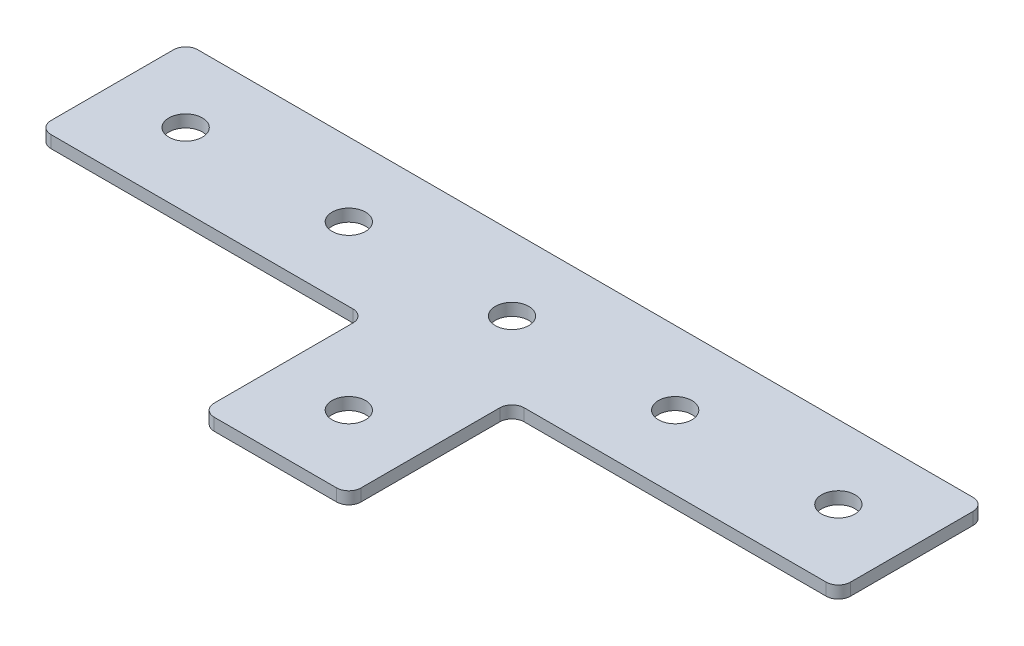
ISO-10303-21;
HEADER;
FILE_DESCRIPTION(('STEP AP214'),'2;1');
FILE_NAME('part.step','',(''),(''),'','','');
FILE_SCHEMA(('AUTOMOTIVE_DESIGN { 1 0 10303 214 1 1 1 1 }'));
ENDSEC;
DATA;
#1=APPLICATION_CONTEXT('core data for automotive mechanical design processes');
#2=APPLICATION_PROTOCOL_DEFINITION('international standard','automotive_design',2000,#1);
#3=PRODUCT_CONTEXT('',#1,'mechanical');
#4=PRODUCT('Part','Part','',(#3));
#5=PRODUCT_RELATED_PRODUCT_CATEGORY('part','',(#4));
#6=PRODUCT_DEFINITION_FORMATION('','',#4);
#7=PRODUCT_DEFINITION_CONTEXT('part definition',#1,'design');
#8=PRODUCT_DEFINITION('design','',#6,#7);
#9=PRODUCT_DEFINITION_SHAPE('','',#8);
#10=(LENGTH_UNIT() NAMED_UNIT(*) SI_UNIT(.MILLI.,.METRE.));
#11=(NAMED_UNIT(*) PLANE_ANGLE_UNIT() SI_UNIT($,.RADIAN.));
#12=(NAMED_UNIT(*) SI_UNIT($,.STERADIAN.) SOLID_ANGLE_UNIT());
#13=UNCERTAINTY_MEASURE_WITH_UNIT(LENGTH_MEASURE(1.E-05),#10,'distance_accuracy_value','');
#14=(GEOMETRIC_REPRESENTATION_CONTEXT(3) GLOBAL_UNCERTAINTY_ASSIGNED_CONTEXT((#13)) GLOBAL_UNIT_ASSIGNED_CONTEXT((#10,
#11,#12)) REPRESENTATION_CONTEXT('',''));
#15=CARTESIAN_POINT('',(0.,0.,0.));
#16=DIRECTION('',(0.,0.,1.));
#17=DIRECTION('',(1.,0.,0.));
#18=AXIS2_PLACEMENT_3D('',#15,#16,#17);
#19=CARTESIAN_POINT('',(-1.67011649585902,1.64126526075142,-21.4706382626173));
#20=DIRECTION('',(0.,-1.,0.));
#21=DIRECTION('',(0.,0.,-1.));
#22=AXIS2_PLACEMENT_3D('',#19,#20,#21);
#23=PLANE('',#22);
#24=CARTESIAN_POINT('',(-1.67011649585902,1.64126526075142,-21.4706382626173));
#25=DIRECTION('',(0.,1.,0.));
#26=DIRECTION('',(0.,0.,1.));
#27=AXIS2_PLACEMENT_3D('',#24,#25,#26);
#28=CIRCLE('',#27,4.1);
#29=CARTESIAN_POINT('',(-1.67011649585902,1.64126526075142,-17.3706382626173));
#30=VERTEX_POINT('',#29);
#31=EDGE_CURVE('E219',#30,#30,#28,.T.);
#32=ORIENTED_EDGE('',*,*,#31,.T.);
#33=EDGE_LOOP('',(#32));
#34=FACE_BOUND('',#33,.T.);
#35=DIRECTION('',(1.,0.,0.));
#36=VECTOR('',#35,1.);
#37=CARTESIAN_POINT('',(-19.670116495859,1.64126526075142,36.5293617373827));
#38=LINE('',#37,#36);
#39=CARTESIAN_POINT('',(-16.670116495859,1.64126526075142,36.5293617373827));
#40=VERTEX_POINT('',#39);
#41=CARTESIAN_POINT('',(13.3298835041409,1.64126526075142,36.5293617373827));
#42=VERTEX_POINT('',#41);
#43=EDGE_CURVE('E231',#40,#42,#38,.T.);
#44=ORIENTED_EDGE('',*,*,#43,.F.);
#45=CARTESIAN_POINT('',(-16.670116495859,1.64126526075142,33.5293617373827));
#46=DIRECTION('',(0.,1.,0.));
#47=DIRECTION('',(0.,0.,-1.));
#48=AXIS2_PLACEMENT_3D('',#45,#46,#47);
#49=CIRCLE('',#48,3.);
#50=CARTESIAN_POINT('',(-19.670116495859,1.64126526075142,33.5293617373827));
#51=VERTEX_POINT('',#50);
#52=EDGE_CURVE('E181',#51,#40,#49,.T.);
#53=ORIENTED_EDGE('',*,*,#52,.F.);
#54=DIRECTION('',(0.,0.,-1.));
#55=VECTOR('',#54,1.);
#56=CARTESIAN_POINT('',(-19.670116495859,1.64126526075142,36.5293617373827));
#57=LINE('',#56,#55);
#58=CARTESIAN_POINT('',(-19.670116495859,1.64126526075142,-0.470638262617281));
#59=VERTEX_POINT('',#58);
#60=EDGE_CURVE('E302',#51,#59,#57,.T.);
#61=ORIENTED_EDGE('',*,*,#60,.T.);
#62=CARTESIAN_POINT('',(-22.670116495859,1.64126526075142,-0.470638262617281));
#63=DIRECTION('',(0.,1.,0.));
#64=DIRECTION('',(0.,0.,-1.));
#65=AXIS2_PLACEMENT_3D('',#62,#63,#64);
#66=CIRCLE('',#65,3.);
#67=CARTESIAN_POINT('',(-22.670116495859,1.64126526075142,-3.47063826261728));
#68=VERTEX_POINT('',#67);
#69=EDGE_CURVE('E197',#68,#59,#66,.F.);
#70=ORIENTED_EDGE('',*,*,#69,.F.);
#71=DIRECTION('',(-1.,0.,0.));
#72=VECTOR('',#71,1.);
#73=CARTESIAN_POINT('',(-19.670116495859,1.64126526075142,-3.47063826261728));
#74=LINE('',#73,#72);
#75=CARTESIAN_POINT('',(-96.670116495859,1.64126526075142,-3.47063826261727));
#76=VERTEX_POINT('',#75);
#77=EDGE_CURVE('E167',#68,#76,#74,.T.);
#78=ORIENTED_EDGE('',*,*,#77,.T.);
#79=CARTESIAN_POINT('',(-96.670116495859,1.64126526075142,-6.47063826261726));
#80=DIRECTION('',(0.,1.,0.));
#81=DIRECTION('',(0.,0.,-1.));
#82=AXIS2_PLACEMENT_3D('',#79,#80,#81);
#83=CIRCLE('',#82,3.);
#84=CARTESIAN_POINT('',(-99.670116495859,1.64126526075142,-6.47063826261726));
#85=VERTEX_POINT('',#84);
#86=EDGE_CURVE('E179',#85,#76,#83,.T.);
#87=ORIENTED_EDGE('',*,*,#86,.F.);
#88=DIRECTION('',(0.,0.,-1.));
#89=VECTOR('',#88,1.);
#90=CARTESIAN_POINT('',(-99.670116495859,1.64126526075142,-3.47063826261727));
#91=LINE('',#90,#89);
#92=CARTESIAN_POINT('',(-99.670116495859,1.64126526075142,-36.4706382626173));
#93=VERTEX_POINT('',#92);
#94=EDGE_CURVE('E147',#85,#93,#91,.T.);
#95=ORIENTED_EDGE('',*,*,#94,.T.);
#96=CARTESIAN_POINT('',(-96.670116495859,1.64126526075142,-36.4706382626173));
#97=DIRECTION('',(0.,1.,0.));
#98=DIRECTION('',(0.,0.,-1.));
#99=AXIS2_PLACEMENT_3D('',#96,#97,#98);
#100=CIRCLE('',#99,3.);
#101=CARTESIAN_POINT('',(-96.670116495859,1.64126526075142,-39.4706382626173));
#102=VERTEX_POINT('',#101);
#103=EDGE_CURVE('E176',#102,#93,#100,.T.);
#104=ORIENTED_EDGE('',*,*,#103,.F.);
#105=DIRECTION('',(-1.,0.,0.));
#106=VECTOR('',#105,1.);
#107=CARTESIAN_POINT('',(96.329883504141,1.64126526075142,-39.4706382626173));
#108=LINE('',#107,#106);
#109=CARTESIAN_POINT('',(93.329883504141,1.64126526075142,-39.4706382626173));
#110=VERTEX_POINT('',#109);
#111=EDGE_CURVE('E228',#110,#102,#108,.T.);
#112=ORIENTED_EDGE('',*,*,#111,.F.);
#113=CARTESIAN_POINT('',(93.329883504141,1.64126526075142,-36.4706382626173));
#114=DIRECTION('',(0.,-1.,0.));
#115=DIRECTION('',(0.,0.,-1.));
#116=AXIS2_PLACEMENT_3D('',#113,#114,#115);
#117=CIRCLE('',#116,3.);
#118=CARTESIAN_POINT('',(96.329883504141,1.64126526075142,-36.4706382626173));
#119=VERTEX_POINT('',#118);
#120=EDGE_CURVE('E258',#110,#119,#117,.T.);
#121=ORIENTED_EDGE('',*,*,#120,.T.);
#122=DIRECTION('',(0.,0.,-1.));
#123=VECTOR('',#122,1.);
#124=CARTESIAN_POINT('',(96.329883504141,1.64126526075142,-3.47063826261729));
#125=LINE('',#124,#123);
#126=CARTESIAN_POINT('',(96.329883504141,1.64126526075142,-6.47063826261729));
#127=VERTEX_POINT('',#126);
#128=EDGE_CURVE('E225',#127,#119,#125,.T.);
#129=ORIENTED_EDGE('',*,*,#128,.F.);
#130=CARTESIAN_POINT('',(93.329883504141,1.64126526075142,-6.47063826261729));
#131=DIRECTION('',(0.,-1.,0.));
#132=DIRECTION('',(0.,0.,-1.));
#133=AXIS2_PLACEMENT_3D('',#130,#131,#132);
#134=CIRCLE('',#133,3.);
#135=CARTESIAN_POINT('',(93.329883504141,1.64126526075142,-3.47063826261729));
#136=VERTEX_POINT('',#135);
#137=EDGE_CURVE('E260',#127,#136,#134,.T.);
#138=ORIENTED_EDGE('',*,*,#137,.T.);
#139=DIRECTION('',(1.,0.,0.));
#140=VECTOR('',#139,1.);
#141=CARTESIAN_POINT('',(16.3298835041409,1.64126526075142,-3.47063826261729));
#142=LINE('',#141,#140);
#143=CARTESIAN_POINT('',(19.3298835041409,1.64126526075142,-3.47063826261729));
#144=VERTEX_POINT('',#143);
#145=EDGE_CURVE('E235',#144,#136,#142,.T.);
#146=ORIENTED_EDGE('',*,*,#145,.F.);
#147=CARTESIAN_POINT('',(19.3298835041409,1.64126526075142,-0.470638262617284));
#148=DIRECTION('',(0.,-1.,0.));
#149=DIRECTION('',(0.,0.,-1.));
#150=AXIS2_PLACEMENT_3D('',#147,#148,#149);
#151=CIRCLE('',#150,3.);
#152=CARTESIAN_POINT('',(16.3298835041409,1.64126526075142,-0.470638262617284));
#153=VERTEX_POINT('',#152);
#154=EDGE_CURVE('E10',#144,#153,#151,.F.);
#155=ORIENTED_EDGE('',*,*,#154,.T.);
#156=DIRECTION('',(0.,0.,-1.));
#157=VECTOR('',#156,1.);
#158=CARTESIAN_POINT('',(16.3298835041409,1.64126526075142,36.5293617373827));
#159=LINE('',#158,#157);
#160=CARTESIAN_POINT('',(16.3298835041409,1.64126526075142,33.5293617373827));
#161=VERTEX_POINT('',#160);
#162=EDGE_CURVE('E233',#161,#153,#159,.T.);
#163=ORIENTED_EDGE('',*,*,#162,.F.);
#164=CARTESIAN_POINT('',(13.3298835041409,1.64126526075142,33.5293617373827));
#165=DIRECTION('',(0.,-1.,0.));
#166=DIRECTION('',(0.,0.,-1.));
#167=AXIS2_PLACEMENT_3D('',#164,#165,#166);
#168=CIRCLE('',#167,3.);
#169=EDGE_CURVE('E262',#161,#42,#168,.T.);
#170=ORIENTED_EDGE('',*,*,#169,.T.);
#171=EDGE_LOOP('',(#44,#53,#61,#70,#78,#87,#95,#104,#112,#121,#129,#138,#146,#155,#163,#170));
#172=FACE_BOUND('',#171,.T.);
#173=CARTESIAN_POINT('',(-1.67011649585903,1.64126526075142,18.5293617373827));
#174=DIRECTION('',(0.,1.,0.));
#175=DIRECTION('',(0.,0.,1.));
#176=AXIS2_PLACEMENT_3D('',#173,#174,#175);
#177=CIRCLE('',#176,4.1);
#178=CARTESIAN_POINT('',(-1.67011649585903,1.64126526075142,22.6293617373827));
#179=VERTEX_POINT('',#178);
#180=EDGE_CURVE('E207',#179,#179,#177,.T.);
#181=ORIENTED_EDGE('',*,*,#180,.T.);
#182=EDGE_LOOP('',(#181));
#183=FACE_BOUND('',#182,.T.);
#184=CARTESIAN_POINT('',(78.329883504141,1.64126526075142,-21.4706382626173));
#185=DIRECTION('',(0.,1.,0.));
#186=DIRECTION('',(0.,0.,1.));
#187=AXIS2_PLACEMENT_3D('',#184,#185,#186);
#188=CIRCLE('',#187,4.1);
#189=CARTESIAN_POINT('',(78.329883504141,1.64126526075142,-17.3706382626173));
#190=VERTEX_POINT('',#189);
#191=EDGE_CURVE('E201',#190,#190,#188,.T.);
#192=ORIENTED_EDGE('',*,*,#191,.T.);
#193=EDGE_LOOP('',(#192));
#194=FACE_BOUND('',#193,.T.);
#195=CARTESIAN_POINT('',(38.329883504141,1.64126526075142,-21.4706382626172));
#196=DIRECTION('',(0.,1.,0.));
#197=DIRECTION('',(0.,0.,1.));
#198=AXIS2_PLACEMENT_3D('',#195,#196,#197);
#199=CIRCLE('',#198,4.1);
#200=CARTESIAN_POINT('',(38.329883504141,1.64126526075142,-17.3706382626173));
#201=VERTEX_POINT('',#200);
#202=EDGE_CURVE('E213',#201,#201,#199,.T.);
#203=ORIENTED_EDGE('',*,*,#202,.T.);
#204=EDGE_LOOP('',(#203));
#205=FACE_BOUND('',#204,.T.);
#206=CARTESIAN_POINT('',(-81.670116495859,1.64126526075142,-21.4706382626172));
#207=DIRECTION('',(0.,-1.,0.));
#208=DIRECTION('',(0.,0.,1.));
#209=AXIS2_PLACEMENT_3D('',#206,#207,#208);
#210=CIRCLE('',#209,4.1);
#211=CARTESIAN_POINT('',(-81.670116495859,1.64126526075142,-17.3706382626172));
#212=VERTEX_POINT('',#211);
#213=EDGE_CURVE('E313',#212,#212,#210,.T.);
#214=ORIENTED_EDGE('',*,*,#213,.F.);
#215=EDGE_LOOP('',(#214));
#216=FACE_BOUND('',#215,.T.);
#217=CARTESIAN_POINT('',(-41.670116495859,1.64126526075142,-21.4706382626172));
#218=DIRECTION('',(0.,-1.,0.));
#219=DIRECTION('',(0.,0.,1.));
#220=AXIS2_PLACEMENT_3D('',#217,#218,#219);
#221=CIRCLE('',#220,4.1);
#222=CARTESIAN_POINT('',(-41.670116495859,1.64126526075142,-17.3706382626172));
#223=VERTEX_POINT('',#222);
#224=EDGE_CURVE('E158',#223,#223,#221,.T.);
#225=ORIENTED_EDGE('',*,*,#224,.F.);
#226=EDGE_LOOP('',(#225));
#227=FACE_BOUND('',#226,.T.);
#228=ADVANCED_FACE('F16',(#34,#172,#183,#194,#205,#216,#227),#23,.T.);
#229=CARTESIAN_POINT('',(96.329883504141,1.64126526075142,-3.47063826261729));
#230=DIRECTION('',(1.,0.,0.));
#231=DIRECTION('',(0.,0.,-1.));
#232=AXIS2_PLACEMENT_3D('',#229,#230,#231);
#233=PLANE('',#232);
#234=DIRECTION('',(0.,0.,-1.));
#235=VECTOR('',#234,1.);
#236=CARTESIAN_POINT('',(96.329883504141,4.64126526075142,-3.47063826261729));
#237=LINE('',#236,#235);
#238=CARTESIAN_POINT('',(96.329883504141,4.64126526075142,-6.47063826261729));
#239=VERTEX_POINT('',#238);
#240=CARTESIAN_POINT('',(96.329883504141,4.64126526075142,-36.4706382626173));
#241=VERTEX_POINT('',#240);
#242=EDGE_CURVE('E222',#239,#241,#237,.T.);
#243=ORIENTED_EDGE('',*,*,#242,.F.);
#244=DIRECTION('',(0.,1.,0.));
#245=VECTOR('',#244,1.);
#246=CARTESIAN_POINT('',(96.329883504141,1.64126526075142,-6.47063826261729));
#247=LINE('',#246,#245);
#248=EDGE_CURVE('E277',#239,#127,#247,.F.);
#249=ORIENTED_EDGE('',*,*,#248,.T.);
#250=ORIENTED_EDGE('',*,*,#128,.T.);
#251=DIRECTION('',(0.,1.,0.));
#252=VECTOR('',#251,1.);
#253=CARTESIAN_POINT('',(96.329883504141,1.64126526075142,-36.4706382626173));
#254=LINE('',#253,#252);
#255=EDGE_CURVE('E274',#119,#241,#254,.T.);
#256=ORIENTED_EDGE('',*,*,#255,.T.);
#257=EDGE_LOOP('',(#243,#249,#250,#256));
#258=FACE_BOUND('',#257,.T.);
#259=ADVANCED_FACE('F326',(#258),#233,.T.);
#260=CARTESIAN_POINT('',(16.3298835041409,1.64126526075142,-3.47063826261729));
#261=DIRECTION('',(0.,0.,1.));
#262=DIRECTION('',(1.,0.,0.));
#263=AXIS2_PLACEMENT_3D('',#260,#261,#262);
#264=PLANE('',#263);
#265=DIRECTION('',(1.,0.,0.));
#266=VECTOR('',#265,1.);
#267=CARTESIAN_POINT('',(16.3298835041409,4.64126526075142,-3.47063826261729));
#268=LINE('',#267,#266);
#269=CARTESIAN_POINT('',(19.3298835041409,4.64126526075142,-3.47063826261729));
#270=VERTEX_POINT('',#269);
#271=CARTESIAN_POINT('',(93.329883504141,4.64126526075142,-3.47063826261729));
#272=VERTEX_POINT('',#271);
#273=EDGE_CURVE('E229',#270,#272,#268,.T.);
#274=ORIENTED_EDGE('',*,*,#273,.F.);
#275=DIRECTION('',(0.,1.,0.));
#276=VECTOR('',#275,1.);
#277=CARTESIAN_POINT('',(19.3298835041409,1.64126526075142,-3.47063826261729));
#278=LINE('',#277,#276);
#279=EDGE_CURVE('E272',#270,#144,#278,.F.);
#280=ORIENTED_EDGE('',*,*,#279,.T.);
#281=ORIENTED_EDGE('',*,*,#145,.T.);
#282=DIRECTION('',(0.,1.,0.));
#283=VECTOR('',#282,1.);
#284=CARTESIAN_POINT('',(93.329883504141,1.64126526075142,-3.47063826261729));
#285=LINE('',#284,#283);
#286=EDGE_CURVE('E269',#136,#272,#285,.T.);
#287=ORIENTED_EDGE('',*,*,#286,.T.);
#288=EDGE_LOOP('',(#274,#280,#281,#287));
#289=FACE_BOUND('',#288,.T.);
#290=ADVANCED_FACE('F285',(#289),#264,.T.);
#291=CARTESIAN_POINT('',(16.3298835041409,1.64126526075142,36.5293617373827));
#292=DIRECTION('',(1.,0.,0.));
#293=DIRECTION('',(0.,0.,-1.));
#294=AXIS2_PLACEMENT_3D('',#291,#292,#293);
#295=PLANE('',#294);
#296=DIRECTION('',(0.,0.,-1.));
#297=VECTOR('',#296,1.);
#298=CARTESIAN_POINT('',(16.3298835041409,4.64126526075142,36.5293617373827));
#299=LINE('',#298,#297);
#300=CARTESIAN_POINT('',(16.3298835041409,4.64126526075142,33.5293617373827));
#301=VERTEX_POINT('',#300);
#302=CARTESIAN_POINT('',(16.3298835041409,4.64126526075142,-0.470638262617284));
#303=VERTEX_POINT('',#302);
#304=EDGE_CURVE('E245',#301,#303,#299,.T.);
#305=ORIENTED_EDGE('',*,*,#304,.F.);
#306=DIRECTION('',(0.,1.,0.));
#307=VECTOR('',#306,1.);
#308=CARTESIAN_POINT('',(16.3298835041409,1.64126526075142,33.5293617373827));
#309=LINE('',#308,#307);
#310=EDGE_CURVE('E36',#301,#161,#309,.F.);
#311=ORIENTED_EDGE('',*,*,#310,.T.);
#312=ORIENTED_EDGE('',*,*,#162,.T.);
#313=DIRECTION('',(0.,1.,0.));
#314=VECTOR('',#313,1.);
#315=CARTESIAN_POINT('',(16.3298835041409,4.64126526075142,-0.470638262617284));
#316=LINE('',#315,#314);
#317=EDGE_CURVE('E265',#153,#303,#316,.T.);
#318=ORIENTED_EDGE('',*,*,#317,.T.);
#319=EDGE_LOOP('',(#305,#311,#312,#318));
#320=FACE_BOUND('',#319,.T.);
#321=ADVANCED_FACE('F288',(#320),#295,.T.);
#322=CARTESIAN_POINT('',(-19.670116495859,1.64126526075142,36.5293617373827));
#323=DIRECTION('',(0.,0.,1.));
#324=DIRECTION('',(1.,0.,0.));
#325=AXIS2_PLACEMENT_3D('',#322,#323,#324);
#326=PLANE('',#325);
#327=DIRECTION('',(1.,0.,0.));
#328=VECTOR('',#327,1.);
#329=CARTESIAN_POINT('',(-19.670116495859,4.64126526075142,36.5293617373827));
#330=LINE('',#329,#328);
#331=CARTESIAN_POINT('',(-16.670116495859,4.64126526075142,36.5293617373827));
#332=VERTEX_POINT('',#331);
#333=CARTESIAN_POINT('',(13.3298835041409,4.64126526075142,36.5293617373827));
#334=VERTEX_POINT('',#333);
#335=EDGE_CURVE('E243',#332,#334,#330,.T.);
#336=ORIENTED_EDGE('',*,*,#335,.F.);
#337=DIRECTION('',(0.,1.,0.));
#338=VECTOR('',#337,1.);
#339=CARTESIAN_POINT('',(-16.670116495859,1.64126526075142,36.5293617373827));
#340=LINE('',#339,#338);
#341=EDGE_CURVE('E173',#40,#332,#340,.T.);
#342=ORIENTED_EDGE('',*,*,#341,.F.);
#343=ORIENTED_EDGE('',*,*,#43,.T.);
#344=DIRECTION('',(0.,1.,0.));
#345=VECTOR('',#344,1.);
#346=CARTESIAN_POINT('',(13.3298835041409,1.64126526075142,36.5293617373827));
#347=LINE('',#346,#345);
#348=EDGE_CURVE('E255',#42,#334,#347,.T.);
#349=ORIENTED_EDGE('',*,*,#348,.T.);
#350=EDGE_LOOP('',(#336,#342,#343,#349));
#351=FACE_BOUND('',#350,.T.);
#352=ADVANCED_FACE('F296',(#351),#326,.T.);
#353=CARTESIAN_POINT('',(96.329883504141,1.64126526075142,-39.4706382626173));
#354=DIRECTION('',(0.,0.,-1.));
#355=DIRECTION('',(-1.,0.,0.));
#356=AXIS2_PLACEMENT_3D('',#353,#354,#355);
#357=PLANE('',#356);
#358=ORIENTED_EDGE('',*,*,#111,.T.);
#359=DIRECTION('',(0.,1.,0.));
#360=VECTOR('',#359,1.);
#361=CARTESIAN_POINT('',(-96.670116495859,1.64126526075142,-39.4706382626173));
#362=LINE('',#361,#360);
#363=CARTESIAN_POINT('',(-96.670116495859,4.64126526075142,-39.4706382626173));
#364=VERTEX_POINT('',#363);
#365=EDGE_CURVE('E149',#364,#102,#362,.F.);
#366=ORIENTED_EDGE('',*,*,#365,.F.);
#367=DIRECTION('',(-1.,0.,0.));
#368=VECTOR('',#367,1.);
#369=CARTESIAN_POINT('',(96.329883504141,4.64126526075142,-39.4706382626173));
#370=LINE('',#369,#368);
#371=CARTESIAN_POINT('',(93.329883504141,4.64126526075142,-39.4706382626173));
#372=VERTEX_POINT('',#371);
#373=EDGE_CURVE('E241',#372,#364,#370,.T.);
#374=ORIENTED_EDGE('',*,*,#373,.F.);
#375=DIRECTION('',(0.,1.,0.));
#376=VECTOR('',#375,1.);
#377=CARTESIAN_POINT('',(93.329883504141,1.64126526075142,-39.4706382626173));
#378=LINE('',#377,#376);
#379=EDGE_CURVE('E279',#372,#110,#378,.F.);
#380=ORIENTED_EDGE('',*,*,#379,.T.);
#381=EDGE_LOOP('',(#358,#366,#374,#380));
#382=FACE_BOUND('',#381,.T.);
#383=ADVANCED_FACE('F339',(#382),#357,.T.);
#384=CARTESIAN_POINT('',(-1.67011649585902,4.64126526075142,-21.4706382626173));
#385=DIRECTION('',(0.,-1.,0.));
#386=DIRECTION('',(0.,0.,-1.));
#387=AXIS2_PLACEMENT_3D('',#384,#385,#386);
#388=PLANE('',#387);
#389=CARTESIAN_POINT('',(-1.67011649585902,4.64126526075142,-21.4706382626173));
#390=DIRECTION('',(0.,1.,0.));
#391=DIRECTION('',(0.,0.,1.));
#392=AXIS2_PLACEMENT_3D('',#389,#390,#391);
#393=CIRCLE('',#392,4.1);
#394=CARTESIAN_POINT('',(-1.67011649585902,4.64126526075142,-17.3706382626173));
#395=VERTEX_POINT('',#394);
#396=EDGE_CURVE('E216',#395,#395,#393,.T.);
#397=ORIENTED_EDGE('',*,*,#396,.F.);
#398=EDGE_LOOP('',(#397));
#399=FACE_BOUND('',#398,.T.);
#400=CARTESIAN_POINT('',(-16.670116495859,4.64126526075142,33.5293617373827));
#401=DIRECTION('',(0.,1.,0.));
#402=DIRECTION('',(0.,0.,-1.));
#403=AXIS2_PLACEMENT_3D('',#400,#401,#402);
#404=CIRCLE('',#403,3.);
#405=CARTESIAN_POINT('',(-19.670116495859,4.64126526075142,33.5293617373827));
#406=VERTEX_POINT('',#405);
#407=EDGE_CURVE('E139',#332,#406,#404,.F.);
#408=ORIENTED_EDGE('',*,*,#407,.F.);
#409=ORIENTED_EDGE('',*,*,#335,.T.);
#410=CARTESIAN_POINT('',(13.3298835041409,4.64126526075142,33.5293617373827));
#411=DIRECTION('',(0.,-1.,0.));
#412=DIRECTION('',(0.,0.,-1.));
#413=AXIS2_PLACEMENT_3D('',#410,#411,#412);
#414=CIRCLE('',#413,3.);
#415=EDGE_CURVE('E253',#334,#301,#414,.F.);
#416=ORIENTED_EDGE('',*,*,#415,.T.);
#417=ORIENTED_EDGE('',*,*,#304,.T.);
#418=CARTESIAN_POINT('',(19.3298835041409,4.64126526075142,-0.470638262617284));
#419=DIRECTION('',(0.,-1.,0.));
#420=DIRECTION('',(0.,0.,-1.));
#421=AXIS2_PLACEMENT_3D('',#418,#419,#420);
#422=CIRCLE('',#421,3.);
#423=EDGE_CURVE('E24',#303,#270,#422,.T.);
#424=ORIENTED_EDGE('',*,*,#423,.T.);
#425=ORIENTED_EDGE('',*,*,#273,.T.);
#426=CARTESIAN_POINT('',(93.329883504141,4.64126526075142,-6.47063826261729));
#427=DIRECTION('',(0.,-1.,0.));
#428=DIRECTION('',(0.,0.,-1.));
#429=AXIS2_PLACEMENT_3D('',#426,#427,#428);
#430=CIRCLE('',#429,3.);
#431=EDGE_CURVE('E251',#272,#239,#430,.F.);
#432=ORIENTED_EDGE('',*,*,#431,.T.);
#433=ORIENTED_EDGE('',*,*,#242,.T.);
#434=CARTESIAN_POINT('',(93.329883504141,4.64126526075142,-36.4706382626173));
#435=DIRECTION('',(0.,-1.,0.));
#436=DIRECTION('',(0.,0.,-1.));
#437=AXIS2_PLACEMENT_3D('',#434,#435,#436);
#438=CIRCLE('',#437,3.);
#439=EDGE_CURVE('E238',#241,#372,#438,.F.);
#440=ORIENTED_EDGE('',*,*,#439,.T.);
#441=ORIENTED_EDGE('',*,*,#373,.T.);
#442=CARTESIAN_POINT('',(-96.670116495859,4.64126526075142,-36.4706382626173));
#443=DIRECTION('',(0.,1.,0.));
#444=DIRECTION('',(0.,0.,-1.));
#445=AXIS2_PLACEMENT_3D('',#442,#443,#444);
#446=CIRCLE('',#445,3.);
#447=CARTESIAN_POINT('',(-99.670116495859,4.64126526075142,-36.4706382626173));
#448=VERTEX_POINT('',#447);
#449=EDGE_CURVE('E140',#448,#364,#446,.F.);
#450=ORIENTED_EDGE('',*,*,#449,.F.);
#451=DIRECTION('',(0.,0.,-1.));
#452=VECTOR('',#451,1.);
#453=CARTESIAN_POINT('',(-99.670116495859,4.64126526075142,-3.47063826261727));
#454=LINE('',#453,#452);
#455=CARTESIAN_POINT('',(-99.670116495859,4.64126526075142,-6.47063826261726));
#456=VERTEX_POINT('',#455);
#457=EDGE_CURVE('E145',#456,#448,#454,.T.);
#458=ORIENTED_EDGE('',*,*,#457,.F.);
#459=CARTESIAN_POINT('',(-96.670116495859,4.64126526075142,-6.47063826261726));
#460=DIRECTION('',(0.,1.,0.));
#461=DIRECTION('',(0.,0.,-1.));
#462=AXIS2_PLACEMENT_3D('',#459,#460,#461);
#463=CIRCLE('',#462,3.);
#464=CARTESIAN_POINT('',(-96.670116495859,4.64126526075142,-3.47063826261727));
#465=VERTEX_POINT('',#464);
#466=EDGE_CURVE('E128',#465,#456,#463,.F.);
#467=ORIENTED_EDGE('',*,*,#466,.F.);
#468=DIRECTION('',(-1.,0.,0.));
#469=VECTOR('',#468,1.);
#470=CARTESIAN_POINT('',(-19.670116495859,4.64126526075142,-3.47063826261728));
#471=LINE('',#470,#469);
#472=CARTESIAN_POINT('',(-22.670116495859,4.64126526075142,-3.47063826261728));
#473=VERTEX_POINT('',#472);
#474=EDGE_CURVE('E161',#473,#465,#471,.T.);
#475=ORIENTED_EDGE('',*,*,#474,.F.);
#476=CARTESIAN_POINT('',(-22.670116495859,4.64126526075142,-0.470638262617281));
#477=DIRECTION('',(0.,1.,0.));
#478=DIRECTION('',(0.,0.,-1.));
#479=AXIS2_PLACEMENT_3D('',#476,#477,#478);
#480=CIRCLE('',#479,3.);
#481=CARTESIAN_POINT('',(-19.670116495859,4.64126526075142,-0.470638262617281));
#482=VERTEX_POINT('',#481);
#483=EDGE_CURVE('E195',#482,#473,#480,.T.);
#484=ORIENTED_EDGE('',*,*,#483,.F.);
#485=DIRECTION('',(0.,0.,-1.));
#486=VECTOR('',#485,1.);
#487=CARTESIAN_POINT('',(-19.670116495859,4.64126526075142,36.5293617373827));
#488=LINE('',#487,#486);
#489=EDGE_CURVE('E157',#406,#482,#488,.T.);
#490=ORIENTED_EDGE('',*,*,#489,.F.);
#491=EDGE_LOOP('',(#408,#409,#416,#417,#424,#425,#432,#433,#440,#441,#450,#458,#467,#475,#484,#490));
#492=FACE_BOUND('',#491,.T.);
#493=CARTESIAN_POINT('',(78.329883504141,4.64126526075142,-21.4706382626173));
#494=DIRECTION('',(0.,1.,0.));
#495=DIRECTION('',(0.,0.,1.));
#496=AXIS2_PLACEMENT_3D('',#493,#494,#495);
#497=CIRCLE('',#496,4.1);
#498=CARTESIAN_POINT('',(78.329883504141,4.64126526075142,-17.3706382626173));
#499=VERTEX_POINT('',#498);
#500=EDGE_CURVE('E200',#499,#499,#497,.T.);
#501=ORIENTED_EDGE('',*,*,#500,.F.);
#502=EDGE_LOOP('',(#501));
#503=FACE_BOUND('',#502,.T.);
#504=CARTESIAN_POINT('',(38.329883504141,4.64126526075142,-21.4706382626172));
#505=DIRECTION('',(0.,1.,0.));
#506=DIRECTION('',(0.,0.,1.));
#507=AXIS2_PLACEMENT_3D('',#504,#505,#506);
#508=CIRCLE('',#507,4.1);
#509=CARTESIAN_POINT('',(38.329883504141,4.64126526075142,-17.3706382626173));
#510=VERTEX_POINT('',#509);
#511=EDGE_CURVE('E210',#510,#510,#508,.T.);
#512=ORIENTED_EDGE('',*,*,#511,.F.);
#513=EDGE_LOOP('',(#512));
#514=FACE_BOUND('',#513,.T.);
#515=CARTESIAN_POINT('',(-1.67011649585903,4.64126526075142,18.5293617373827));
#516=DIRECTION('',(0.,1.,0.));
#517=DIRECTION('',(0.,0.,1.));
#518=AXIS2_PLACEMENT_3D('',#515,#516,#517);
#519=CIRCLE('',#518,4.1);
#520=CARTESIAN_POINT('',(-1.67011649585903,4.64126526075142,22.6293617373827));
#521=VERTEX_POINT('',#520);
#522=EDGE_CURVE('E204',#521,#521,#519,.T.);
#523=ORIENTED_EDGE('',*,*,#522,.F.);
#524=EDGE_LOOP('',(#523));
#525=FACE_BOUND('',#524,.T.);
#526=CARTESIAN_POINT('',(-81.670116495859,4.64126526075142,-21.4706382626172));
#527=DIRECTION('',(0.,-1.,0.));
#528=DIRECTION('',(0.,0.,1.));
#529=AXIS2_PLACEMENT_3D('',#526,#527,#528);
#530=CIRCLE('',#529,4.1);
#531=CARTESIAN_POINT('',(-81.670116495859,4.64126526075142,-17.3706382626172));
#532=VERTEX_POINT('',#531);
#533=EDGE_CURVE('E315',#532,#532,#530,.T.);
#534=ORIENTED_EDGE('',*,*,#533,.T.);
#535=EDGE_LOOP('',(#534));
#536=FACE_BOUND('',#535,.T.);
#537=CARTESIAN_POINT('',(-41.670116495859,4.64126526075142,-21.4706382626172));
#538=DIRECTION('',(0.,-1.,0.));
#539=DIRECTION('',(0.,0.,1.));
#540=AXIS2_PLACEMENT_3D('',#537,#538,#539);
#541=CIRCLE('',#540,4.1);
#542=CARTESIAN_POINT('',(-41.670116495859,4.64126526075142,-17.3706382626172));
#543=VERTEX_POINT('',#542);
#544=EDGE_CURVE('E164',#543,#543,#541,.T.);
#545=ORIENTED_EDGE('',*,*,#544,.T.);
#546=EDGE_LOOP('',(#545));
#547=FACE_BOUND('',#546,.T.);
#548=ADVANCED_FACE('F153',(#399,#492,#503,#514,#525,#536,#547),#388,.F.);
#549=CARTESIAN_POINT('',(13.3298835041409,1.64126526075142,33.5293617373827));
#550=DIRECTION('',(0.,1.,0.));
#551=DIRECTION('',(0.,0.,1.));
#552=AXIS2_PLACEMENT_3D('',#549,#550,#551);
#553=CYLINDRICAL_SURFACE('',#552,3.);
#554=ORIENTED_EDGE('',*,*,#169,.F.);
#555=ORIENTED_EDGE('',*,*,#310,.F.);
#556=ORIENTED_EDGE('',*,*,#415,.F.);
#557=ORIENTED_EDGE('',*,*,#348,.F.);
#558=EDGE_LOOP('',(#554,#555,#556,#557));
#559=FACE_BOUND('',#558,.T.);
#560=ADVANCED_FACE('F293',(#559),#553,.T.);
#561=CARTESIAN_POINT('',(19.3298835041409,1.64126526075142,-0.470638262617284));
#562=DIRECTION('',(0.,-1.,0.));
#563=DIRECTION('',(0.,0.,-1.));
#564=AXIS2_PLACEMENT_3D('',#561,#562,#563);
#565=CYLINDRICAL_SURFACE('',#564,3.);
#566=ORIENTED_EDGE('',*,*,#154,.F.);
#567=ORIENTED_EDGE('',*,*,#279,.F.);
#568=ORIENTED_EDGE('',*,*,#423,.F.);
#569=ORIENTED_EDGE('',*,*,#317,.F.);
#570=EDGE_LOOP('',(#566,#567,#568,#569));
#571=FACE_BOUND('',#570,.T.);
#572=ADVANCED_FACE('F287',(#571),#565,.F.);
#573=CARTESIAN_POINT('',(93.329883504141,1.64126526075142,-6.47063826261729));
#574=DIRECTION('',(0.,1.,0.));
#575=DIRECTION('',(0.,0.,1.));
#576=AXIS2_PLACEMENT_3D('',#573,#574,#575);
#577=CYLINDRICAL_SURFACE('',#576,3.);
#578=ORIENTED_EDGE('',*,*,#137,.F.);
#579=ORIENTED_EDGE('',*,*,#248,.F.);
#580=ORIENTED_EDGE('',*,*,#431,.F.);
#581=ORIENTED_EDGE('',*,*,#286,.F.);
#582=EDGE_LOOP('',(#578,#579,#580,#581));
#583=FACE_BOUND('',#582,.T.);
#584=ADVANCED_FACE('F354',(#583),#577,.T.);
#585=CARTESIAN_POINT('',(93.329883504141,1.64126526075142,-36.4706382626173));
#586=DIRECTION('',(0.,1.,0.));
#587=DIRECTION('',(0.,0.,1.));
#588=AXIS2_PLACEMENT_3D('',#585,#586,#587);
#589=CYLINDRICAL_SURFACE('',#588,3.);
#590=ORIENTED_EDGE('',*,*,#120,.F.);
#591=ORIENTED_EDGE('',*,*,#379,.F.);
#592=ORIENTED_EDGE('',*,*,#439,.F.);
#593=ORIENTED_EDGE('',*,*,#255,.F.);
#594=EDGE_LOOP('',(#590,#591,#592,#593));
#595=FACE_BOUND('',#594,.T.);
#596=ADVANCED_FACE('F18',(#595),#589,.T.);
#597=CARTESIAN_POINT('',(-1.67011649585902,1.64126526075142,-21.4706382626173));
#598=DIRECTION('',(0.,1.,0.));
#599=DIRECTION('',(0.,0.,1.));
#600=AXIS2_PLACEMENT_3D('',#597,#598,#599);
#601=CYLINDRICAL_SURFACE('',#600,4.1);
#602=ORIENTED_EDGE('',*,*,#31,.F.);
#603=EDGE_LOOP('',(#602));
#604=FACE_BOUND('',#603,.T.);
#605=ORIENTED_EDGE('',*,*,#396,.T.);
#606=EDGE_LOOP('',(#605));
#607=FACE_BOUND('',#606,.T.);
#608=ADVANCED_FACE('F360',(#604,#607),#601,.F.);
#609=CARTESIAN_POINT('',(38.329883504141,1.64126526075142,-21.4706382626172));
#610=DIRECTION('',(0.,1.,0.));
#611=DIRECTION('',(0.,0.,1.));
#612=AXIS2_PLACEMENT_3D('',#609,#610,#611);
#613=CYLINDRICAL_SURFACE('',#612,4.1);
#614=ORIENTED_EDGE('',*,*,#202,.F.);
#615=EDGE_LOOP('',(#614));
#616=FACE_BOUND('',#615,.T.);
#617=ORIENTED_EDGE('',*,*,#511,.T.);
#618=EDGE_LOOP('',(#617));
#619=FACE_BOUND('',#618,.T.);
#620=ADVANCED_FACE('F400',(#616,#619),#613,.F.);
#621=CARTESIAN_POINT('',(-1.67011649585903,1.64126526075142,18.5293617373827));
#622=DIRECTION('',(0.,1.,0.));
#623=DIRECTION('',(0.,0.,1.));
#624=AXIS2_PLACEMENT_3D('',#621,#622,#623);
#625=CYLINDRICAL_SURFACE('',#624,4.1);
#626=ORIENTED_EDGE('',*,*,#522,.T.);
#627=EDGE_LOOP('',(#626));
#628=FACE_BOUND('',#627,.T.);
#629=ORIENTED_EDGE('',*,*,#180,.F.);
#630=EDGE_LOOP('',(#629));
#631=FACE_BOUND('',#630,.T.);
#632=ADVANCED_FACE('F396',(#628,#631),#625,.F.);
#633=CARTESIAN_POINT('',(78.329883504141,1.64126526075142,-21.4706382626173));
#634=DIRECTION('',(0.,1.,0.));
#635=DIRECTION('',(0.,0.,1.));
#636=AXIS2_PLACEMENT_3D('',#633,#634,#635);
#637=CYLINDRICAL_SURFACE('',#636,4.1);
#638=ORIENTED_EDGE('',*,*,#191,.F.);
#639=EDGE_LOOP('',(#638));
#640=FACE_BOUND('',#639,.T.);
#641=ORIENTED_EDGE('',*,*,#500,.T.);
#642=EDGE_LOOP('',(#641));
#643=FACE_BOUND('',#642,.T.);
#644=ADVANCED_FACE('F393',(#640,#643),#637,.F.);
#645=CARTESIAN_POINT('',(-99.670116495859,1.64126526075142,-3.47063826261727));
#646=DIRECTION('',(-1.,0.,0.));
#647=DIRECTION('',(0.,0.,-1.));
#648=AXIS2_PLACEMENT_3D('',#645,#646,#647);
#649=PLANE('',#648);
#650=ORIENTED_EDGE('',*,*,#457,.T.);
#651=DIRECTION('',(0.,1.,0.));
#652=VECTOR('',#651,1.);
#653=CARTESIAN_POINT('',(-99.670116495859,1.64126526075142,-36.4706382626173));
#654=LINE('',#653,#652);
#655=EDGE_CURVE('E150',#93,#448,#654,.T.);
#656=ORIENTED_EDGE('',*,*,#655,.F.);
#657=ORIENTED_EDGE('',*,*,#94,.F.);
#658=DIRECTION('',(0.,1.,0.));
#659=VECTOR('',#658,1.);
#660=CARTESIAN_POINT('',(-99.670116495859,1.64126526075142,-6.47063826261726));
#661=LINE('',#660,#659);
#662=EDGE_CURVE('E132',#456,#85,#661,.F.);
#663=ORIENTED_EDGE('',*,*,#662,.F.);
#664=EDGE_LOOP('',(#650,#656,#657,#663));
#665=FACE_BOUND('',#664,.T.);
#666=ADVANCED_FACE('F144',(#665),#649,.T.);
#667=CARTESIAN_POINT('',(-19.670116495859,1.64126526075142,-3.47063826261728));
#668=DIRECTION('',(0.,0.,1.));
#669=DIRECTION('',(-1.,0.,0.));
#670=AXIS2_PLACEMENT_3D('',#667,#668,#669);
#671=PLANE('',#670);
#672=ORIENTED_EDGE('',*,*,#474,.T.);
#673=DIRECTION('',(0.,1.,0.));
#674=VECTOR('',#673,1.);
#675=CARTESIAN_POINT('',(-96.670116495859,1.64126526075142,-3.47063826261727));
#676=LINE('',#675,#674);
#677=EDGE_CURVE('E134',#76,#465,#676,.T.);
#678=ORIENTED_EDGE('',*,*,#677,.F.);
#679=ORIENTED_EDGE('',*,*,#77,.F.);
#680=DIRECTION('',(0.,1.,0.));
#681=VECTOR('',#680,1.);
#682=CARTESIAN_POINT('',(-22.670116495859,1.64126526075142,-3.47063826261728));
#683=LINE('',#682,#681);
#684=EDGE_CURVE('E190',#473,#68,#683,.F.);
#685=ORIENTED_EDGE('',*,*,#684,.F.);
#686=EDGE_LOOP('',(#672,#678,#679,#685));
#687=FACE_BOUND('',#686,.T.);
#688=ADVANCED_FACE('F378',(#687),#671,.T.);
#689=CARTESIAN_POINT('',(-19.670116495859,1.64126526075142,36.5293617373827));
#690=DIRECTION('',(-1.,0.,0.));
#691=DIRECTION('',(0.,0.,-1.));
#692=AXIS2_PLACEMENT_3D('',#689,#690,#691);
#693=PLANE('',#692);
#694=ORIENTED_EDGE('',*,*,#489,.T.);
#695=DIRECTION('',(0.,1.,0.));
#696=VECTOR('',#695,1.);
#697=CARTESIAN_POINT('',(-19.670116495859,4.64126526075142,-0.470638262617281));
#698=LINE('',#697,#696);
#699=EDGE_CURVE('E184',#59,#482,#698,.T.);
#700=ORIENTED_EDGE('',*,*,#699,.F.);
#701=ORIENTED_EDGE('',*,*,#60,.F.);
#702=DIRECTION('',(0.,1.,0.));
#703=VECTOR('',#702,1.);
#704=CARTESIAN_POINT('',(-19.670116495859,1.64126526075142,33.5293617373827));
#705=LINE('',#704,#703);
#706=EDGE_CURVE('E187',#406,#51,#705,.F.);
#707=ORIENTED_EDGE('',*,*,#706,.F.);
#708=EDGE_LOOP('',(#694,#700,#701,#707));
#709=FACE_BOUND('',#708,.T.);
#710=ADVANCED_FACE('F308',(#709),#693,.T.);
#711=CARTESIAN_POINT('',(-16.670116495859,1.64126526075142,33.5293617373827));
#712=DIRECTION('',(0.,1.,0.));
#713=DIRECTION('',(0.,0.,1.));
#714=AXIS2_PLACEMENT_3D('',#711,#712,#713);
#715=CYLINDRICAL_SURFACE('',#714,3.);
#716=ORIENTED_EDGE('',*,*,#52,.T.);
#717=ORIENTED_EDGE('',*,*,#341,.T.);
#718=ORIENTED_EDGE('',*,*,#407,.T.);
#719=ORIENTED_EDGE('',*,*,#706,.T.);
#720=EDGE_LOOP('',(#716,#717,#718,#719));
#721=FACE_BOUND('',#720,.T.);
#722=ADVANCED_FACE('F304',(#721),#715,.T.);
#723=CARTESIAN_POINT('',(-22.670116495859,1.64126526075142,-0.470638262617281));
#724=DIRECTION('',(0.,-1.,0.));
#725=DIRECTION('',(0.,0.,-1.));
#726=AXIS2_PLACEMENT_3D('',#723,#724,#725);
#727=CYLINDRICAL_SURFACE('',#726,3.);
#728=ORIENTED_EDGE('',*,*,#69,.T.);
#729=ORIENTED_EDGE('',*,*,#699,.T.);
#730=ORIENTED_EDGE('',*,*,#483,.T.);
#731=ORIENTED_EDGE('',*,*,#684,.T.);
#732=EDGE_LOOP('',(#728,#729,#730,#731));
#733=FACE_BOUND('',#732,.T.);
#734=ADVANCED_FACE('F380',(#733),#727,.F.);
#735=CARTESIAN_POINT('',(-96.670116495859,1.64126526075142,-6.47063826261726));
#736=DIRECTION('',(0.,1.,0.));
#737=DIRECTION('',(0.,0.,1.));
#738=AXIS2_PLACEMENT_3D('',#735,#736,#737);
#739=CYLINDRICAL_SURFACE('',#738,3.);
#740=ORIENTED_EDGE('',*,*,#86,.T.);
#741=ORIENTED_EDGE('',*,*,#677,.T.);
#742=ORIENTED_EDGE('',*,*,#466,.T.);
#743=ORIENTED_EDGE('',*,*,#662,.T.);
#744=EDGE_LOOP('',(#740,#741,#742,#743));
#745=FACE_BOUND('',#744,.T.);
#746=ADVANCED_FACE('F131',(#745),#739,.T.);
#747=CARTESIAN_POINT('',(-96.670116495859,1.64126526075142,-36.4706382626173));
#748=DIRECTION('',(0.,1.,0.));
#749=DIRECTION('',(0.,0.,1.));
#750=AXIS2_PLACEMENT_3D('',#747,#748,#749);
#751=CYLINDRICAL_SURFACE('',#750,3.);
#752=ORIENTED_EDGE('',*,*,#103,.T.);
#753=ORIENTED_EDGE('',*,*,#655,.T.);
#754=ORIENTED_EDGE('',*,*,#449,.T.);
#755=ORIENTED_EDGE('',*,*,#365,.T.);
#756=EDGE_LOOP('',(#752,#753,#754,#755));
#757=FACE_BOUND('',#756,.T.);
#758=ADVANCED_FACE('F334',(#757),#751,.T.);
#759=CARTESIAN_POINT('',(-41.670116495859,1.64126526075142,-21.4706382626172));
#760=DIRECTION('',(0.,1.,0.));
#761=DIRECTION('',(0.,0.,1.));
#762=AXIS2_PLACEMENT_3D('',#759,#760,#761);
#763=CYLINDRICAL_SURFACE('',#762,4.1);
#764=ORIENTED_EDGE('',*,*,#224,.T.);
#765=EDGE_LOOP('',(#764));
#766=FACE_BOUND('',#765,.T.);
#767=ORIENTED_EDGE('',*,*,#544,.F.);
#768=EDGE_LOOP('',(#767));
#769=FACE_BOUND('',#768,.T.);
#770=ADVANCED_FACE('F331',(#766,#769),#763,.F.);
#771=CARTESIAN_POINT('',(-81.670116495859,1.64126526075142,-21.4706382626172));
#772=DIRECTION('',(0.,1.,0.));
#773=DIRECTION('',(0.,0.,1.));
#774=AXIS2_PLACEMENT_3D('',#771,#772,#773);
#775=CYLINDRICAL_SURFACE('',#774,4.1);
#776=ORIENTED_EDGE('',*,*,#213,.T.);
#777=EDGE_LOOP('',(#776));
#778=FACE_BOUND('',#777,.T.);
#779=ORIENTED_EDGE('',*,*,#533,.F.);
#780=EDGE_LOOP('',(#779));
#781=FACE_BOUND('',#780,.T.);
#782=ADVANCED_FACE('F321',(#778,#781),#775,.F.);
#783=CLOSED_SHELL('',(#228,#259,#290,#321,#352,#383,#548,#560,#572,#584,#596,#608,#620,#632,
#644,#666,#688,#710,#722,#734,#746,#758,#770,#782));
#784=MANIFOLD_SOLID_BREP('B1',#783);
#785=ADVANCED_BREP_SHAPE_REPRESENTATION('',(#18,#784),#14);
#786=SHAPE_DEFINITION_REPRESENTATION(#9,#785);
ENDSEC;
END-ISO-10303-21;
